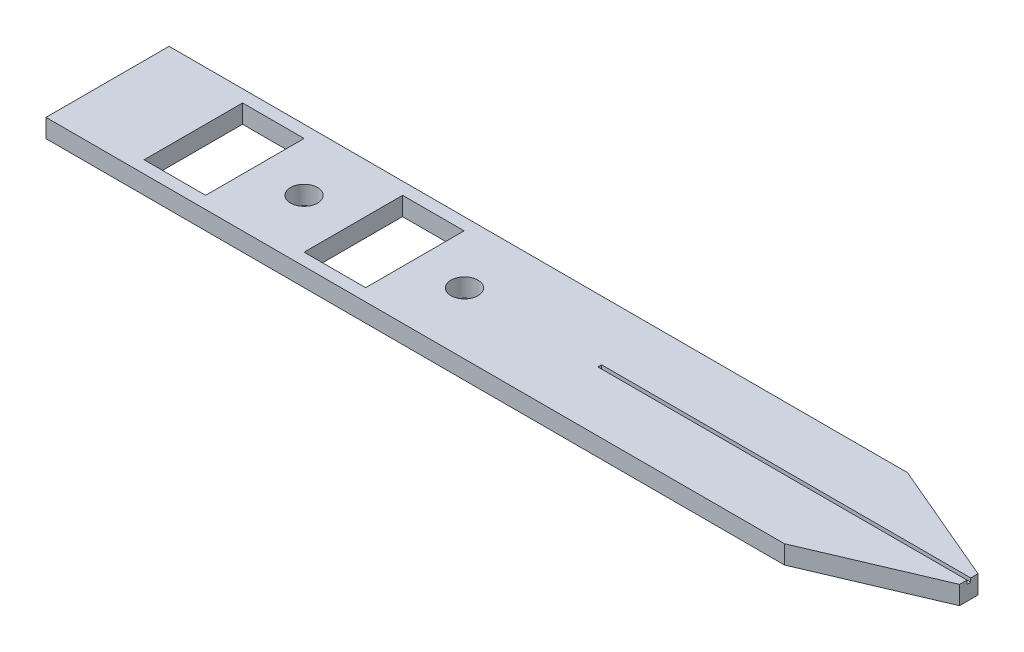
ISO-10303-21;
HEADER;
FILE_DESCRIPTION(('STEP AP214'),'2;1');
FILE_NAME('part.step','',(''),(''),'','','');
FILE_SCHEMA(('AUTOMOTIVE_DESIGN { 1 0 10303 214 1 1 1 1 }'));
ENDSEC;
DATA;
#1=APPLICATION_CONTEXT('core data for automotive mechanical design processes');
#2=APPLICATION_PROTOCOL_DEFINITION('international standard','automotive_design',2000,#1);
#3=PRODUCT_CONTEXT('',#1,'mechanical');
#4=PRODUCT('Part','Part','',(#3));
#5=PRODUCT_RELATED_PRODUCT_CATEGORY('part','',(#4));
#6=PRODUCT_DEFINITION_FORMATION('','',#4);
#7=PRODUCT_DEFINITION_CONTEXT('part definition',#1,'design');
#8=PRODUCT_DEFINITION('design','',#6,#7);
#9=PRODUCT_DEFINITION_SHAPE('','',#8);
#10=(LENGTH_UNIT() NAMED_UNIT(*) SI_UNIT(.MILLI.,.METRE.));
#11=(NAMED_UNIT(*) PLANE_ANGLE_UNIT() SI_UNIT($,.RADIAN.));
#12=(NAMED_UNIT(*) SI_UNIT($,.STERADIAN.) SOLID_ANGLE_UNIT());
#13=UNCERTAINTY_MEASURE_WITH_UNIT(LENGTH_MEASURE(1.E-05),#10,'distance_accuracy_value','');
#14=(GEOMETRIC_REPRESENTATION_CONTEXT(3) GLOBAL_UNCERTAINTY_ASSIGNED_CONTEXT((#13)) GLOBAL_UNIT_ASSIGNED_CONTEXT((#10,
#11,#12)) REPRESENTATION_CONTEXT('',''));
#15=CARTESIAN_POINT('',(0.,0.,0.));
#16=DIRECTION('',(0.,0.,1.));
#17=DIRECTION('',(1.,0.,0.));
#18=AXIS2_PLACEMENT_3D('',#15,#16,#17);
#19=CARTESIAN_POINT('',(-4.39473443120233,32.2692901678604,49.7465812895776));
#20=DIRECTION('',(0.,0.,1.));
#21=DIRECTION('',(1.,0.,0.));
#22=AXIS2_PLACEMENT_3D('',#19,#20,#21);
#23=PLANE('',#22);
#24=DIRECTION('',(-1.,0.,0.));
#25=VECTOR('',#24,1.);
#26=CARTESIAN_POINT('',(-4.39473443120233,30.7692901678604,49.7465812895776));
#27=LINE('',#26,#25);
#28=CARTESIAN_POINT('',(55.6052655687977,30.7692901678604,49.7465812895776));
#29=VERTEX_POINT('',#28);
#30=CARTESIAN_POINT('',(-4.39473443120233,30.7692901678604,49.7465812895776));
#31=VERTEX_POINT('',#30);
#32=EDGE_CURVE('E270',#29,#31,#27,.T.);
#33=ORIENTED_EDGE('',*,*,#32,.T.);
#34=DIRECTION('',(0.,-1.,0.));
#35=VECTOR('',#34,1.);
#36=CARTESIAN_POINT('',(-4.39473443120233,32.2692901678604,49.7465812895776));
#37=LINE('',#36,#35);
#38=CARTESIAN_POINT('',(-4.39473443120233,32.2692901678604,49.7465812895776));
#39=VERTEX_POINT('',#38);
#40=EDGE_CURVE('E286',#39,#31,#37,.T.);
#41=ORIENTED_EDGE('',*,*,#40,.F.);
#42=DIRECTION('',(-1.,0.,0.));
#43=VECTOR('',#42,1.);
#44=CARTESIAN_POINT('',(-4.39473443120233,32.2692901678604,49.7465812895776));
#45=LINE('',#44,#43);
#46=CARTESIAN_POINT('',(55.6052655687977,32.2692901678604,49.7465812895776));
#47=VERTEX_POINT('',#46);
#48=EDGE_CURVE('E272',#47,#39,#45,.T.);
#49=ORIENTED_EDGE('',*,*,#48,.F.);
#50=DIRECTION('',(0.,-1.,0.));
#51=VECTOR('',#50,1.);
#52=CARTESIAN_POINT('',(55.6052655687977,32.2692901678604,49.7465812895776));
#53=LINE('',#52,#51);
#54=EDGE_CURVE('E210',#47,#29,#53,.T.);
#55=ORIENTED_EDGE('',*,*,#54,.T.);
#56=EDGE_LOOP('',(#33,#41,#49,#55));
#57=FACE_BOUND('',#56,.T.);
#58=ADVANCED_FACE('F34',(#57),#23,.F.);
#59=CARTESIAN_POINT('',(-4.39473443120233,32.2692901678604,49.7465812895776));
#60=DIRECTION('',(1.,0.,0.));
#61=DIRECTION('',(0.,0.,-1.));
#62=AXIS2_PLACEMENT_3D('',#59,#60,#61);
#63=PLANE('',#62);
#64=DIRECTION('',(0.,0.,1.));
#65=VECTOR('',#64,1.);
#66=CARTESIAN_POINT('',(-4.39473443120233,30.7692901678604,49.7465812895776));
#67=LINE('',#66,#65);
#68=CARTESIAN_POINT('',(-4.39473443120233,30.7692901678604,59.7465812895776));
#69=VERTEX_POINT('',#68);
#70=EDGE_CURVE('E281',#31,#69,#67,.T.);
#71=ORIENTED_EDGE('',*,*,#70,.T.);
#72=DIRECTION('',(0.,-1.,0.));
#73=VECTOR('',#72,1.);
#74=CARTESIAN_POINT('',(-4.39473443120233,32.2692901678604,59.7465812895776));
#75=LINE('',#74,#73);
#76=CARTESIAN_POINT('',(-4.39473443120233,32.2692901678604,59.7465812895776));
#77=VERTEX_POINT('',#76);
#78=EDGE_CURVE('E279',#77,#69,#75,.T.);
#79=ORIENTED_EDGE('',*,*,#78,.F.);
#80=DIRECTION('',(0.,0.,1.));
#81=VECTOR('',#80,1.);
#82=CARTESIAN_POINT('',(-4.39473443120233,32.2692901678604,49.7465812895776));
#83=LINE('',#82,#81);
#84=EDGE_CURVE('E274',#39,#77,#83,.T.);
#85=ORIENTED_EDGE('',*,*,#84,.F.);
#86=ORIENTED_EDGE('',*,*,#40,.T.);
#87=EDGE_LOOP('',(#71,#79,#85,#86));
#88=FACE_BOUND('',#87,.T.);
#89=ADVANCED_FACE('F342',(#88),#63,.F.);
#90=CARTESIAN_POINT('',(-4.39473443120233,32.2692901678604,59.7465812895776));
#91=DIRECTION('',(0.,0.,-1.));
#92=DIRECTION('',(-1.,0.,0.));
#93=AXIS2_PLACEMENT_3D('',#90,#91,#92);
#94=PLANE('',#93);
#95=DIRECTION('',(1.,0.,0.));
#96=VECTOR('',#95,1.);
#97=CARTESIAN_POINT('',(-4.39473443120233,30.7692901678604,59.7465812895776));
#98=LINE('',#97,#96);
#99=CARTESIAN_POINT('',(55.6052655687977,30.7692901678604,59.7465812895776));
#100=VERTEX_POINT('',#99);
#101=EDGE_CURVE('E275',#69,#100,#98,.T.);
#102=ORIENTED_EDGE('',*,*,#101,.T.);
#103=DIRECTION('',(0.,-1.,0.));
#104=VECTOR('',#103,1.);
#105=CARTESIAN_POINT('',(55.6052655687977,32.2692901678604,59.7465812895776));
#106=LINE('',#105,#104);
#107=CARTESIAN_POINT('',(55.6052655687977,32.2692901678604,59.7465812895776));
#108=VERTEX_POINT('',#107);
#109=EDGE_CURVE('E201',#108,#100,#106,.T.);
#110=ORIENTED_EDGE('',*,*,#109,.F.);
#111=DIRECTION('',(1.,0.,0.));
#112=VECTOR('',#111,1.);
#113=CARTESIAN_POINT('',(-4.39473443120233,32.2692901678604,59.7465812895776));
#114=LINE('',#113,#112);
#115=EDGE_CURVE('E277',#77,#108,#114,.T.);
#116=ORIENTED_EDGE('',*,*,#115,.F.);
#117=ORIENTED_EDGE('',*,*,#78,.T.);
#118=EDGE_LOOP('',(#102,#110,#116,#117));
#119=FACE_BOUND('',#118,.T.);
#120=ADVANCED_FACE('F347',(#119),#94,.F.);
#121=CARTESIAN_POINT('',(20.6052655687977,32.2692901678604,54.7465812895776));
#122=DIRECTION('',(0.,1.,0.));
#123=DIRECTION('',(0.,0.,1.));
#124=AXIS2_PLACEMENT_3D('',#121,#122,#123);
#125=PLANE('',#124);
#126=CARTESIAN_POINT('',(24.6052655687977,32.2692901678604,54.7465812895776));
#127=DIRECTION('',(0.,1.,0.));
#128=DIRECTION('',(0.,0.,1.));
#129=AXIS2_PLACEMENT_3D('',#126,#127,#128);
#130=CIRCLE('',#129,1.1);
#131=CARTESIAN_POINT('',(24.6052655687977,32.2692901678604,55.8465812895776));
#132=VERTEX_POINT('',#131);
#133=EDGE_CURVE('E219',#132,#132,#130,.T.);
#134=ORIENTED_EDGE('',*,*,#133,.F.);
#135=EDGE_LOOP('',(#134));
#136=FACE_BOUND('',#135,.T.);
#137=DIRECTION('',(1.,0.,0.));
#138=VECTOR('',#137,1.);
#139=CARTESIAN_POINT('',(15.5752655687977,32.2692901678604,58.7465812895776));
#140=LINE('',#139,#138);
#141=CARTESIAN_POINT('',(15.5752655687977,32.2692901678604,58.7465812895776));
#142=VERTEX_POINT('',#141);
#143=CARTESIAN_POINT('',(20.5752655687977,32.2692901678604,58.7465812895776));
#144=VERTEX_POINT('',#143);
#145=EDGE_CURVE('E49',#142,#144,#140,.T.);
#146=ORIENTED_EDGE('',*,*,#145,.F.);
#147=DIRECTION('',(0.,0.,1.));
#148=VECTOR('',#147,1.);
#149=CARTESIAN_POINT('',(15.5752655687977,32.2692901678604,50.7465812895776));
#150=LINE('',#149,#148);
#151=CARTESIAN_POINT('',(15.5752655687977,32.2692901678604,50.7465812895776));
#152=VERTEX_POINT('',#151);
#153=EDGE_CURVE('E228',#152,#142,#150,.T.);
#154=ORIENTED_EDGE('',*,*,#153,.F.);
#155=DIRECTION('',(-1.,0.,0.));
#156=VECTOR('',#155,1.);
#157=CARTESIAN_POINT('',(15.5752655687977,32.2692901678604,50.7465812895776));
#158=LINE('',#157,#156);
#159=CARTESIAN_POINT('',(20.5752655687977,32.2692901678604,50.7465812895776));
#160=VERTEX_POINT('',#159);
#161=EDGE_CURVE('E225',#160,#152,#158,.T.);
#162=ORIENTED_EDGE('',*,*,#161,.F.);
#163=DIRECTION('',(0.,0.,-1.));
#164=VECTOR('',#163,1.);
#165=CARTESIAN_POINT('',(20.5752655687977,32.2692901678604,58.7465812895776));
#166=LINE('',#165,#164);
#167=EDGE_CURVE('E223',#144,#160,#166,.T.);
#168=ORIENTED_EDGE('',*,*,#167,.F.);
#169=EDGE_LOOP('',(#146,#154,#162,#168));
#170=FACE_BOUND('',#169,.T.);
#171=CARTESIAN_POINT('',(11.5752655687977,32.2692901678604,54.7465812895776));
#172=DIRECTION('',(0.,1.,0.));
#173=DIRECTION('',(0.,0.,1.));
#174=AXIS2_PLACEMENT_3D('',#171,#172,#173);
#175=CIRCLE('',#174,1.1);
#176=CARTESIAN_POINT('',(11.5752655687977,32.2692901678604,55.8465812895776));
#177=VERTEX_POINT('',#176);
#178=EDGE_CURVE('E234',#177,#177,#175,.T.);
#179=ORIENTED_EDGE('',*,*,#178,.F.);
#180=EDGE_LOOP('',(#179));
#181=FACE_BOUND('',#180,.T.);
#182=DIRECTION('',(1.,0.,0.));
#183=VECTOR('',#182,1.);
#184=CARTESIAN_POINT('',(2.57526556879767,32.2692901678604,58.7465812895776));
#185=LINE('',#184,#183);
#186=CARTESIAN_POINT('',(2.57526556879767,32.2692901678604,58.7465812895776));
#187=VERTEX_POINT('',#186);
#188=CARTESIAN_POINT('',(7.57526556879766,32.2692901678604,58.7465812895776));
#189=VERTEX_POINT('',#188);
#190=EDGE_CURVE('E242',#187,#189,#185,.T.);
#191=ORIENTED_EDGE('',*,*,#190,.F.);
#192=DIRECTION('',(0.,0.,1.));
#193=VECTOR('',#192,1.);
#194=CARTESIAN_POINT('',(2.57526556879766,32.2692901678604,50.7465812895776));
#195=LINE('',#194,#193);
#196=CARTESIAN_POINT('',(2.57526556879766,32.2692901678604,50.7465812895776));
#197=VERTEX_POINT('',#196);
#198=EDGE_CURVE('E250',#197,#187,#195,.T.);
#199=ORIENTED_EDGE('',*,*,#198,.F.);
#200=DIRECTION('',(-1.,0.,0.));
#201=VECTOR('',#200,1.);
#202=CARTESIAN_POINT('',(2.57526556879766,32.2692901678604,50.7465812895776));
#203=LINE('',#202,#201);
#204=CARTESIAN_POINT('',(7.57526556879766,32.2692901678604,50.7465812895776));
#205=VERTEX_POINT('',#204);
#206=EDGE_CURVE('E247',#205,#197,#203,.T.);
#207=ORIENTED_EDGE('',*,*,#206,.F.);
#208=DIRECTION('',(0.,0.,-1.));
#209=VECTOR('',#208,1.);
#210=CARTESIAN_POINT('',(7.57526556879766,32.2692901678604,58.7465812895776));
#211=LINE('',#210,#209);
#212=EDGE_CURVE('E244',#189,#205,#211,.T.);
#213=ORIENTED_EDGE('',*,*,#212,.F.);
#214=EDGE_LOOP('',(#191,#199,#207,#213));
#215=FACE_BOUND('',#214,.T.);
#216=DIRECTION('',(1.,0.,0.));
#217=VECTOR('',#216,1.);
#218=CARTESIAN_POINT('',(35.5801578419851,32.2692901678604,54.8865812853747));
#219=LINE('',#218,#217);
#220=CARTESIAN_POINT('',(35.5801578419851,32.2692901678604,54.8865812853747));
#221=VERTEX_POINT('',#220);
#222=CARTESIAN_POINT('',(65.5801578419851,32.2692901678604,54.8865812853747));
#223=VERTEX_POINT('',#222);
#224=EDGE_CURVE('E172',#221,#223,#219,.T.);
#225=ORIENTED_EDGE('',*,*,#224,.F.);
#226=DIRECTION('',(0.,0.,1.));
#227=VECTOR('',#226,1.);
#228=CARTESIAN_POINT('',(35.5801578419851,32.2692901678604,54.5865812853747));
#229=LINE('',#228,#227);
#230=CARTESIAN_POINT('',(35.5801578419851,32.2692901678604,54.5865812853747));
#231=VERTEX_POINT('',#230);
#232=EDGE_CURVE('E256',#231,#221,#229,.T.);
#233=ORIENTED_EDGE('',*,*,#232,.F.);
#234=DIRECTION('',(-1.,0.,0.));
#235=VECTOR('',#234,1.);
#236=CARTESIAN_POINT('',(20.6052655687977,32.2692901678604,54.5865812853747));
#237=LINE('',#236,#235);
#238=CARTESIAN_POINT('',(65.5801578419851,32.2692901678604,54.5865812853747));
#239=VERTEX_POINT('',#238);
#240=EDGE_CURVE('E289',#239,#231,#237,.T.);
#241=ORIENTED_EDGE('',*,*,#240,.F.);
#242=DIRECTION('',(0.,0.,-1.));
#243=VECTOR('',#242,1.);
#244=CARTESIAN_POINT('',(65.5801578419851,32.2692901678604,53.9965812895776));
#245=LINE('',#244,#243);
#246=CARTESIAN_POINT('',(65.5801578419851,32.2692901678604,53.9965812895776));
#247=VERTEX_POINT('',#246);
#248=EDGE_CURVE('E185',#239,#247,#245,.T.);
#249=ORIENTED_EDGE('',*,*,#248,.T.);
#250=DIRECTION('',(-0.919976264981925,0.,-0.391974070405054));
#251=VECTOR('',#250,1.);
#252=CARTESIAN_POINT('',(65.5801578419851,32.2692901678604,53.9965812895776));
#253=LINE('',#252,#251);
#254=EDGE_CURVE('E198',#247,#47,#253,.T.);
#255=ORIENTED_EDGE('',*,*,#254,.T.);
#256=ORIENTED_EDGE('',*,*,#48,.T.);
#257=ORIENTED_EDGE('',*,*,#84,.T.);
#258=ORIENTED_EDGE('',*,*,#115,.T.);
#259=DIRECTION('',(0.919976264981925,0.,-0.391974070405054));
#260=VECTOR('',#259,1.);
#261=CARTESIAN_POINT('',(65.5801578419851,32.2692901678604,55.4965812895776));
#262=LINE('',#261,#260);
#263=CARTESIAN_POINT('',(65.5801578419851,32.2692901678604,55.4965812895776));
#264=VERTEX_POINT('',#263);
#265=EDGE_CURVE('E191',#108,#264,#262,.T.);
#266=ORIENTED_EDGE('',*,*,#265,.T.);
#267=EDGE_CURVE('E195',#264,#223,#245,.T.);
#268=ORIENTED_EDGE('',*,*,#267,.T.);
#269=EDGE_LOOP('',(#225,#233,#241,#249,#255,#256,#257,#258,#266,#268));
#270=FACE_BOUND('',#269,.T.);
#271=ADVANCED_FACE('F325',(#136,#170,#181,#215,#270),#125,.T.);
#272=CARTESIAN_POINT('',(20.6052655687977,30.7692901678604,54.7465812895776));
#273=DIRECTION('',(0.,1.,0.));
#274=DIRECTION('',(0.,0.,1.));
#275=AXIS2_PLACEMENT_3D('',#272,#273,#274);
#276=PLANE('',#275);
#277=CARTESIAN_POINT('',(24.6052655687977,30.7692901678604,54.7465812895776));
#278=DIRECTION('',(0.,1.,0.));
#279=DIRECTION('',(0.,0.,1.));
#280=AXIS2_PLACEMENT_3D('',#277,#278,#279);
#281=CIRCLE('',#280,1.1);
#282=CARTESIAN_POINT('',(24.6052655687977,30.7692901678604,55.8465812895776));
#283=VERTEX_POINT('',#282);
#284=EDGE_CURVE('E37',#283,#283,#281,.T.);
#285=ORIENTED_EDGE('',*,*,#284,.T.);
#286=EDGE_LOOP('',(#285));
#287=FACE_BOUND('',#286,.T.);
#288=DIRECTION('',(0.,0.,1.));
#289=VECTOR('',#288,1.);
#290=CARTESIAN_POINT('',(15.5752655687977,30.7692901678604,54.7465812895776));
#291=LINE('',#290,#289);
#292=CARTESIAN_POINT('',(15.5752655687977,30.7692901678604,50.7465812895776));
#293=VERTEX_POINT('',#292);
#294=CARTESIAN_POINT('',(15.5752655687977,30.7692901678604,58.7465812895776));
#295=VERTEX_POINT('',#294);
#296=EDGE_CURVE('E42',#293,#295,#291,.T.);
#297=ORIENTED_EDGE('',*,*,#296,.T.);
#298=DIRECTION('',(1.,0.,0.));
#299=VECTOR('',#298,1.);
#300=CARTESIAN_POINT('',(20.6052655687977,30.7692901678604,58.7465812895776));
#301=LINE('',#300,#299);
#302=CARTESIAN_POINT('',(20.5752655687977,30.7692901678604,58.7465812895776));
#303=VERTEX_POINT('',#302);
#304=EDGE_CURVE('E11',#295,#303,#301,.T.);
#305=ORIENTED_EDGE('',*,*,#304,.T.);
#306=DIRECTION('',(0.,0.,-1.));
#307=VECTOR('',#306,1.);
#308=CARTESIAN_POINT('',(20.5752655687977,30.7692901678604,54.7465812895776));
#309=LINE('',#308,#307);
#310=CARTESIAN_POINT('',(20.5752655687977,30.7692901678604,50.7465812895776));
#311=VERTEX_POINT('',#310);
#312=EDGE_CURVE('E303',#303,#311,#309,.T.);
#313=ORIENTED_EDGE('',*,*,#312,.T.);
#314=DIRECTION('',(-1.,0.,0.));
#315=VECTOR('',#314,1.);
#316=CARTESIAN_POINT('',(20.6052655687977,30.7692901678604,50.7465812895776));
#317=LINE('',#316,#315);
#318=EDGE_CURVE('E308',#311,#293,#317,.T.);
#319=ORIENTED_EDGE('',*,*,#318,.T.);
#320=EDGE_LOOP('',(#297,#305,#313,#319));
#321=FACE_BOUND('',#320,.T.);
#322=CARTESIAN_POINT('',(11.5752655687977,30.7692901678604,54.7465812895776));
#323=DIRECTION('',(0.,1.,0.));
#324=DIRECTION('',(0.,0.,1.));
#325=AXIS2_PLACEMENT_3D('',#322,#323,#324);
#326=CIRCLE('',#325,1.1);
#327=CARTESIAN_POINT('',(11.5752655687977,30.7692901678604,55.8465812895776));
#328=VERTEX_POINT('',#327);
#329=EDGE_CURVE('E241',#328,#328,#326,.T.);
#330=ORIENTED_EDGE('',*,*,#329,.T.);
#331=EDGE_LOOP('',(#330));
#332=FACE_BOUND('',#331,.T.);
#333=DIRECTION('',(0.,0.,1.));
#334=VECTOR('',#333,1.);
#335=CARTESIAN_POINT('',(2.57526556879766,30.7692901678604,54.7465812895776));
#336=LINE('',#335,#334);
#337=CARTESIAN_POINT('',(2.57526556879766,30.7692901678604,50.7465812895776));
#338=VERTEX_POINT('',#337);
#339=CARTESIAN_POINT('',(2.57526556879767,30.7692901678604,58.7465812895776));
#340=VERTEX_POINT('',#339);
#341=EDGE_CURVE('E297',#338,#340,#336,.T.);
#342=ORIENTED_EDGE('',*,*,#341,.T.);
#343=DIRECTION('',(1.,0.,0.));
#344=VECTOR('',#343,1.);
#345=CARTESIAN_POINT('',(20.6052655687977,30.7692901678604,58.7465812895776));
#346=LINE('',#345,#344);
#347=CARTESIAN_POINT('',(7.57526556879766,30.7692901678604,58.7465812895776));
#348=VERTEX_POINT('',#347);
#349=EDGE_CURVE('E300',#340,#348,#346,.T.);
#350=ORIENTED_EDGE('',*,*,#349,.T.);
#351=DIRECTION('',(0.,0.,-1.));
#352=VECTOR('',#351,1.);
#353=CARTESIAN_POINT('',(7.57526556879766,30.7692901678604,54.7465812895776));
#354=LINE('',#353,#352);
#355=CARTESIAN_POINT('',(7.57526556879766,30.7692901678604,50.7465812895776));
#356=VERTEX_POINT('',#355);
#357=EDGE_CURVE('E291',#348,#356,#354,.T.);
#358=ORIENTED_EDGE('',*,*,#357,.T.);
#359=DIRECTION('',(-1.,0.,0.));
#360=VECTOR('',#359,1.);
#361=CARTESIAN_POINT('',(20.6052655687977,30.7692901678604,50.7465812895776));
#362=LINE('',#361,#360);
#363=EDGE_CURVE('E294',#356,#338,#362,.T.);
#364=ORIENTED_EDGE('',*,*,#363,.T.);
#365=EDGE_LOOP('',(#342,#350,#358,#364));
#366=FACE_BOUND('',#365,.T.);
#367=ORIENTED_EDGE('',*,*,#32,.F.);
#368=DIRECTION('',(-0.919976264981925,0.,-0.391974070405054));
#369=VECTOR('',#368,1.);
#370=CARTESIAN_POINT('',(65.5801578419851,30.7692901678604,53.9965812895776));
#371=LINE('',#370,#369);
#372=CARTESIAN_POINT('',(65.5801578419851,30.7692901678604,53.9965812895776));
#373=VERTEX_POINT('',#372);
#374=EDGE_CURVE('E194',#373,#29,#371,.T.);
#375=ORIENTED_EDGE('',*,*,#374,.F.);
#376=DIRECTION('',(0.,0.,-1.));
#377=VECTOR('',#376,1.);
#378=CARTESIAN_POINT('',(65.5801578419851,30.7692901678604,53.9965812895776));
#379=LINE('',#378,#377);
#380=CARTESIAN_POINT('',(65.5801578419851,30.7692901678604,55.4965812895776));
#381=VERTEX_POINT('',#380);
#382=EDGE_CURVE('E204',#381,#373,#379,.T.);
#383=ORIENTED_EDGE('',*,*,#382,.F.);
#384=DIRECTION('',(0.919976264981925,0.,-0.391974070405054));
#385=VECTOR('',#384,1.);
#386=CARTESIAN_POINT('',(65.5801578419851,30.7692901678604,55.4965812895776));
#387=LINE('',#386,#385);
#388=EDGE_CURVE('E188',#100,#381,#387,.T.);
#389=ORIENTED_EDGE('',*,*,#388,.F.);
#390=ORIENTED_EDGE('',*,*,#101,.F.);
#391=ORIENTED_EDGE('',*,*,#70,.F.);
#392=EDGE_LOOP('',(#367,#375,#383,#389,#390,#391));
#393=FACE_BOUND('',#392,.T.);
#394=ADVANCED_FACE('F313',(#287,#321,#332,#366,#393),#276,.F.);
#395=CARTESIAN_POINT('',(8.56861161537381,31.9692901678604,-1.14667946462532));
#396=DIRECTION('',(0.,1.,0.));
#397=DIRECTION('',(0.,0.,1.));
#398=AXIS2_PLACEMENT_3D('',#395,#396,#397);
#399=PLANE('',#398);
#400=DIRECTION('',(1.,0.,0.));
#401=VECTOR('',#400,1.);
#402=CARTESIAN_POINT('',(35.5801578419851,31.9692901678604,54.8865812853747));
#403=LINE('',#402,#401);
#404=CARTESIAN_POINT('',(35.5801578419851,31.9692901678604,54.8865812853747));
#405=VERTEX_POINT('',#404);
#406=CARTESIAN_POINT('',(65.5801578419851,31.9692901678604,54.8865812853747));
#407=VERTEX_POINT('',#406);
#408=EDGE_CURVE('E178',#405,#407,#403,.T.);
#409=ORIENTED_EDGE('',*,*,#408,.T.);
#410=DIRECTION('',(0.,0.,-1.));
#411=VECTOR('',#410,1.);
#412=CARTESIAN_POINT('',(65.5801578419851,31.9692901678604,54.5865812853747));
#413=LINE('',#412,#411);
#414=CARTESIAN_POINT('',(65.5801578419851,31.9692901678604,54.5865812853747));
#415=VERTEX_POINT('',#414);
#416=EDGE_CURVE('E175',#407,#415,#413,.T.);
#417=ORIENTED_EDGE('',*,*,#416,.T.);
#418=DIRECTION('',(-1.,0.,0.));
#419=VECTOR('',#418,1.);
#420=CARTESIAN_POINT('',(35.5801578419851,31.9692901678604,54.5865812853747));
#421=LINE('',#420,#419);
#422=CARTESIAN_POINT('',(35.5801578419851,31.9692901678604,54.5865812853747));
#423=VERTEX_POINT('',#422);
#424=EDGE_CURVE('E160',#415,#423,#421,.T.);
#425=ORIENTED_EDGE('',*,*,#424,.T.);
#426=DIRECTION('',(0.,0.,1.));
#427=VECTOR('',#426,1.);
#428=CARTESIAN_POINT('',(35.5801578419851,31.9692901678604,54.5865812853747));
#429=LINE('',#428,#427);
#430=EDGE_CURVE('E171',#423,#405,#429,.T.);
#431=ORIENTED_EDGE('',*,*,#430,.T.);
#432=EDGE_LOOP('',(#409,#417,#425,#431));
#433=FACE_BOUND('',#432,.T.);
#434=ADVANCED_FACE('F176',(#433),#399,.T.);
#435=CARTESIAN_POINT('',(35.5801578419851,31.9692901678604,54.8865812853747));
#436=DIRECTION('',(0.,0.,1.));
#437=DIRECTION('',(1.,0.,0.));
#438=AXIS2_PLACEMENT_3D('',#435,#436,#437);
#439=PLANE('',#438);
#440=ORIENTED_EDGE('',*,*,#408,.F.);
#441=DIRECTION('',(0.,1.,0.));
#442=VECTOR('',#441,1.);
#443=CARTESIAN_POINT('',(35.5801578419851,31.9692901678604,54.8865812853747));
#444=LINE('',#443,#442);
#445=EDGE_CURVE('E268',#405,#221,#444,.T.);
#446=ORIENTED_EDGE('',*,*,#445,.T.);
#447=ORIENTED_EDGE('',*,*,#224,.T.);
#448=DIRECTION('',(0.,1.,0.));
#449=VECTOR('',#448,1.);
#450=CARTESIAN_POINT('',(65.5801578419851,31.9692901678604,54.8865812853747));
#451=LINE('',#450,#449);
#452=EDGE_CURVE('E186',#407,#223,#451,.T.);
#453=ORIENTED_EDGE('',*,*,#452,.F.);
#454=EDGE_LOOP('',(#440,#446,#447,#453));
#455=FACE_BOUND('',#454,.T.);
#456=ADVANCED_FACE('F371',(#455),#439,.F.);
#457=CARTESIAN_POINT('',(35.5801578419851,31.9692901678604,54.5865812853747));
#458=DIRECTION('',(0.,0.,-1.));
#459=DIRECTION('',(-1.,0.,0.));
#460=AXIS2_PLACEMENT_3D('',#457,#458,#459);
#461=PLANE('',#460);
#462=ORIENTED_EDGE('',*,*,#240,.T.);
#463=DIRECTION('',(0.,1.,0.));
#464=VECTOR('',#463,1.);
#465=CARTESIAN_POINT('',(35.5801578419851,31.9692901678604,54.5865812853747));
#466=LINE('',#465,#464);
#467=EDGE_CURVE('E167',#423,#231,#466,.T.);
#468=ORIENTED_EDGE('',*,*,#467,.F.);
#469=ORIENTED_EDGE('',*,*,#424,.F.);
#470=DIRECTION('',(0.,1.,0.));
#471=VECTOR('',#470,1.);
#472=CARTESIAN_POINT('',(65.5801578419851,31.9692901678604,54.5865812853747));
#473=LINE('',#472,#471);
#474=EDGE_CURVE('E164',#415,#239,#473,.T.);
#475=ORIENTED_EDGE('',*,*,#474,.T.);
#476=EDGE_LOOP('',(#462,#468,#469,#475));
#477=FACE_BOUND('',#476,.T.);
#478=ADVANCED_FACE('F162',(#477),#461,.F.);
#479=CARTESIAN_POINT('',(35.5801578419851,31.9692901678604,54.5865812853747));
#480=DIRECTION('',(-1.,0.,0.));
#481=DIRECTION('',(0.,0.,1.));
#482=AXIS2_PLACEMENT_3D('',#479,#480,#481);
#483=PLANE('',#482);
#484=ORIENTED_EDGE('',*,*,#232,.T.);
#485=ORIENTED_EDGE('',*,*,#445,.F.);
#486=ORIENTED_EDGE('',*,*,#430,.F.);
#487=ORIENTED_EDGE('',*,*,#467,.T.);
#488=EDGE_LOOP('',(#484,#485,#486,#487));
#489=FACE_BOUND('',#488,.T.);
#490=ADVANCED_FACE('F374',(#489),#483,.F.);
#491=CARTESIAN_POINT('',(2.57526556879767,22.2692901678604,58.7465812895776));
#492=DIRECTION('',(0.,0.,1.));
#493=DIRECTION('',(1.,0.,0.));
#494=AXIS2_PLACEMENT_3D('',#491,#492,#493);
#495=PLANE('',#494);
#496=DIRECTION('',(0.,1.,0.));
#497=VECTOR('',#496,1.);
#498=CARTESIAN_POINT('',(2.57526556879767,22.2692901678604,58.7465812895776));
#499=LINE('',#498,#497);
#500=EDGE_CURVE('E254',#340,#187,#499,.T.);
#501=ORIENTED_EDGE('',*,*,#500,.T.);
#502=ORIENTED_EDGE('',*,*,#190,.T.);
#503=DIRECTION('',(0.,1.,0.));
#504=VECTOR('',#503,1.);
#505=CARTESIAN_POINT('',(7.57526556879766,22.2692901678604,58.7465812895776));
#506=LINE('',#505,#504);
#507=EDGE_CURVE('E253',#348,#189,#506,.T.);
#508=ORIENTED_EDGE('',*,*,#507,.F.);
#509=ORIENTED_EDGE('',*,*,#349,.F.);
#510=EDGE_LOOP('',(#501,#502,#508,#509));
#511=FACE_BOUND('',#510,.T.);
#512=ADVANCED_FACE('F376',(#511),#495,.F.);
#513=CARTESIAN_POINT('',(2.57526556879766,22.2692901678604,50.7465812895776));
#514=DIRECTION('',(-1.,0.,0.));
#515=DIRECTION('',(0.,0.,1.));
#516=AXIS2_PLACEMENT_3D('',#513,#514,#515);
#517=PLANE('',#516);
#518=DIRECTION('',(0.,1.,0.));
#519=VECTOR('',#518,1.);
#520=CARTESIAN_POINT('',(2.57526556879766,22.2692901678604,50.7465812895776));
#521=LINE('',#520,#519);
#522=EDGE_CURVE('E257',#338,#197,#521,.T.);
#523=ORIENTED_EDGE('',*,*,#522,.T.);
#524=ORIENTED_EDGE('',*,*,#198,.T.);
#525=ORIENTED_EDGE('',*,*,#500,.F.);
#526=ORIENTED_EDGE('',*,*,#341,.F.);
#527=EDGE_LOOP('',(#523,#524,#525,#526));
#528=FACE_BOUND('',#527,.T.);
#529=ADVANCED_FACE('F382',(#528),#517,.F.);
#530=CARTESIAN_POINT('',(2.57526556879766,22.2692901678604,50.7465812895776));
#531=DIRECTION('',(0.,0.,-1.));
#532=DIRECTION('',(-1.,0.,0.));
#533=AXIS2_PLACEMENT_3D('',#530,#531,#532);
#534=PLANE('',#533);
#535=DIRECTION('',(0.,1.,0.));
#536=VECTOR('',#535,1.);
#537=CARTESIAN_POINT('',(7.57526556879766,22.2692901678604,50.7465812895776));
#538=LINE('',#537,#536);
#539=EDGE_CURVE('E259',#356,#205,#538,.T.);
#540=ORIENTED_EDGE('',*,*,#539,.T.);
#541=ORIENTED_EDGE('',*,*,#206,.T.);
#542=ORIENTED_EDGE('',*,*,#522,.F.);
#543=ORIENTED_EDGE('',*,*,#363,.F.);
#544=EDGE_LOOP('',(#540,#541,#542,#543));
#545=FACE_BOUND('',#544,.T.);
#546=ADVANCED_FACE('F515',(#545),#534,.F.);
#547=CARTESIAN_POINT('',(7.57526556879766,22.2692901678604,58.7465812895776));
#548=DIRECTION('',(1.,0.,0.));
#549=DIRECTION('',(0.,0.,-1.));
#550=AXIS2_PLACEMENT_3D('',#547,#548,#549);
#551=PLANE('',#550);
#552=ORIENTED_EDGE('',*,*,#507,.T.);
#553=ORIENTED_EDGE('',*,*,#212,.T.);
#554=ORIENTED_EDGE('',*,*,#539,.F.);
#555=ORIENTED_EDGE('',*,*,#357,.F.);
#556=EDGE_LOOP('',(#552,#553,#554,#555));
#557=FACE_BOUND('',#556,.T.);
#558=ADVANCED_FACE('F337',(#557),#551,.F.);
#559=CARTESIAN_POINT('',(11.5752655687977,22.2692901678604,54.7465812895776));
#560=DIRECTION('',(0.,1.,0.));
#561=DIRECTION('',(0.,0.,1.));
#562=AXIS2_PLACEMENT_3D('',#559,#560,#561);
#563=CYLINDRICAL_SURFACE('',#562,1.1);
#564=ORIENTED_EDGE('',*,*,#178,.T.);
#565=EDGE_LOOP('',(#564));
#566=FACE_BOUND('',#565,.T.);
#567=ORIENTED_EDGE('',*,*,#329,.F.);
#568=EDGE_LOOP('',(#567));
#569=FACE_BOUND('',#568,.T.);
#570=ADVANCED_FACE('F330',(#566,#569),#563,.F.);
#571=CARTESIAN_POINT('',(15.5752655687977,22.2692901678604,58.7465812895776));
#572=DIRECTION('',(0.,0.,1.));
#573=DIRECTION('',(1.,0.,0.));
#574=AXIS2_PLACEMENT_3D('',#571,#572,#573);
#575=PLANE('',#574);
#576=DIRECTION('',(0.,1.,0.));
#577=VECTOR('',#576,1.);
#578=CARTESIAN_POINT('',(15.5752655687977,22.2692901678604,58.7465812895776));
#579=LINE('',#578,#577);
#580=EDGE_CURVE('E232',#295,#142,#579,.T.);
#581=ORIENTED_EDGE('',*,*,#580,.T.);
#582=ORIENTED_EDGE('',*,*,#145,.T.);
#583=DIRECTION('',(0.,1.,0.));
#584=VECTOR('',#583,1.);
#585=CARTESIAN_POINT('',(20.5752655687977,22.2692901678604,58.7465812895776));
#586=LINE('',#585,#584);
#587=EDGE_CURVE('E231',#303,#144,#586,.T.);
#588=ORIENTED_EDGE('',*,*,#587,.F.);
#589=ORIENTED_EDGE('',*,*,#304,.F.);
#590=EDGE_LOOP('',(#581,#582,#588,#589));
#591=FACE_BOUND('',#590,.T.);
#592=ADVANCED_FACE('F328',(#591),#575,.F.);
#593=CARTESIAN_POINT('',(15.5752655687977,22.2692901678604,50.7465812895776));
#594=DIRECTION('',(-1.,0.,0.));
#595=DIRECTION('',(0.,0.,1.));
#596=AXIS2_PLACEMENT_3D('',#593,#594,#595);
#597=PLANE('',#596);
#598=DIRECTION('',(0.,1.,0.));
#599=VECTOR('',#598,1.);
#600=CARTESIAN_POINT('',(15.5752655687977,22.2692901678604,50.7465812895776));
#601=LINE('',#600,#599);
#602=EDGE_CURVE('E235',#293,#152,#601,.T.);
#603=ORIENTED_EDGE('',*,*,#602,.T.);
#604=ORIENTED_EDGE('',*,*,#153,.T.);
#605=ORIENTED_EDGE('',*,*,#580,.F.);
#606=ORIENTED_EDGE('',*,*,#296,.F.);
#607=EDGE_LOOP('',(#603,#604,#605,#606));
#608=FACE_BOUND('',#607,.T.);
#609=ADVANCED_FACE('F318',(#608),#597,.F.);
#610=CARTESIAN_POINT('',(15.5752655687977,22.2692901678604,50.7465812895776));
#611=DIRECTION('',(0.,0.,-1.));
#612=DIRECTION('',(-1.,0.,0.));
#613=AXIS2_PLACEMENT_3D('',#610,#611,#612);
#614=PLANE('',#613);
#615=DIRECTION('',(0.,1.,0.));
#616=VECTOR('',#615,1.);
#617=CARTESIAN_POINT('',(20.5752655687977,22.2692901678604,50.7465812895776));
#618=LINE('',#617,#616);
#619=EDGE_CURVE('E57',#311,#160,#618,.T.);
#620=ORIENTED_EDGE('',*,*,#619,.T.);
#621=ORIENTED_EDGE('',*,*,#161,.T.);
#622=ORIENTED_EDGE('',*,*,#602,.F.);
#623=ORIENTED_EDGE('',*,*,#318,.F.);
#624=EDGE_LOOP('',(#620,#621,#622,#623));
#625=FACE_BOUND('',#624,.T.);
#626=ADVANCED_FACE('F320',(#625),#614,.F.);
#627=CARTESIAN_POINT('',(20.5752655687977,22.2692901678604,58.7465812895776));
#628=DIRECTION('',(1.,0.,0.));
#629=DIRECTION('',(0.,0.,-1.));
#630=AXIS2_PLACEMENT_3D('',#627,#628,#629);
#631=PLANE('',#630);
#632=ORIENTED_EDGE('',*,*,#587,.T.);
#633=ORIENTED_EDGE('',*,*,#167,.T.);
#634=ORIENTED_EDGE('',*,*,#619,.F.);
#635=ORIENTED_EDGE('',*,*,#312,.F.);
#636=EDGE_LOOP('',(#632,#633,#634,#635));
#637=FACE_BOUND('',#636,.T.);
#638=ADVANCED_FACE('F327',(#637),#631,.F.);
#639=CARTESIAN_POINT('',(24.6052655687977,22.2692901678604,54.7465812895776));
#640=DIRECTION('',(0.,1.,0.));
#641=DIRECTION('',(0.,0.,1.));
#642=AXIS2_PLACEMENT_3D('',#639,#640,#641);
#643=CYLINDRICAL_SURFACE('',#642,1.1);
#644=ORIENTED_EDGE('',*,*,#133,.T.);
#645=EDGE_LOOP('',(#644));
#646=FACE_BOUND('',#645,.T.);
#647=ORIENTED_EDGE('',*,*,#284,.F.);
#648=EDGE_LOOP('',(#647));
#649=FACE_BOUND('',#648,.T.);
#650=ADVANCED_FACE('F424',(#646,#649),#643,.F.);
#651=CARTESIAN_POINT('',(65.5801578419851,32.2692901678604,55.4965812895776));
#652=DIRECTION('',(-0.391974070405054,0.,-0.919976264981925));
#653=DIRECTION('',(-0.919976264981925,0.,0.391974070405054));
#654=AXIS2_PLACEMENT_3D('',#651,#652,#653);
#655=PLANE('',#654);
#656=ORIENTED_EDGE('',*,*,#388,.T.);
#657=DIRECTION('',(0.,-1.,0.));
#658=VECTOR('',#657,1.);
#659=CARTESIAN_POINT('',(65.5801578419851,32.2692901678604,55.4965812895776));
#660=LINE('',#659,#658);
#661=EDGE_CURVE('E216',#264,#381,#660,.T.);
#662=ORIENTED_EDGE('',*,*,#661,.F.);
#663=ORIENTED_EDGE('',*,*,#265,.F.);
#664=ORIENTED_EDGE('',*,*,#109,.T.);
#665=EDGE_LOOP('',(#656,#662,#663,#664));
#666=FACE_BOUND('',#665,.T.);
#667=ADVANCED_FACE('F363',(#666),#655,.F.);
#668=CARTESIAN_POINT('',(65.5801578419851,32.2692901678604,53.9965812895776));
#669=DIRECTION('',(-1.,0.,0.));
#670=DIRECTION('',(0.,0.,1.));
#671=AXIS2_PLACEMENT_3D('',#668,#669,#670);
#672=PLANE('',#671);
#673=ORIENTED_EDGE('',*,*,#416,.F.);
#674=ORIENTED_EDGE('',*,*,#452,.T.);
#675=ORIENTED_EDGE('',*,*,#267,.F.);
#676=ORIENTED_EDGE('',*,*,#661,.T.);
#677=ORIENTED_EDGE('',*,*,#382,.T.);
#678=DIRECTION('',(0.,-1.,0.));
#679=VECTOR('',#678,1.);
#680=CARTESIAN_POINT('',(65.5801578419851,32.2692901678604,53.9965812895776));
#681=LINE('',#680,#679);
#682=EDGE_CURVE('E213',#247,#373,#681,.T.);
#683=ORIENTED_EDGE('',*,*,#682,.F.);
#684=ORIENTED_EDGE('',*,*,#248,.F.);
#685=ORIENTED_EDGE('',*,*,#474,.F.);
#686=EDGE_LOOP('',(#673,#674,#675,#676,#677,#683,#684,#685));
#687=FACE_BOUND('',#686,.T.);
#688=ADVANCED_FACE('F183',(#687),#672,.F.);
#689=CARTESIAN_POINT('',(65.5801578419851,32.2692901678604,53.9965812895776));
#690=DIRECTION('',(-0.391974070405054,0.,0.919976264981925));
#691=DIRECTION('',(0.919976264981925,0.,0.391974070405054));
#692=AXIS2_PLACEMENT_3D('',#689,#690,#691);
#693=PLANE('',#692);
#694=ORIENTED_EDGE('',*,*,#374,.T.);
#695=ORIENTED_EDGE('',*,*,#54,.F.);
#696=ORIENTED_EDGE('',*,*,#254,.F.);
#697=ORIENTED_EDGE('',*,*,#682,.T.);
#698=EDGE_LOOP('',(#694,#695,#696,#697));
#699=FACE_BOUND('',#698,.T.);
#700=ADVANCED_FACE('F369',(#699),#693,.F.);
#701=CLOSED_SHELL('',(#58,#89,#120,#271,#394,#434,#456,#478,#490,#512,#529,#546,#558,#570,#592,
#609,#626,#638,#650,#667,#688,#700));
#702=MANIFOLD_SOLID_BREP('B2',#701);
#703=ADVANCED_BREP_SHAPE_REPRESENTATION('',(#18,#702),#14);
#704=SHAPE_DEFINITION_REPRESENTATION(#9,#703);
ENDSEC;
END-ISO-10303-21;
